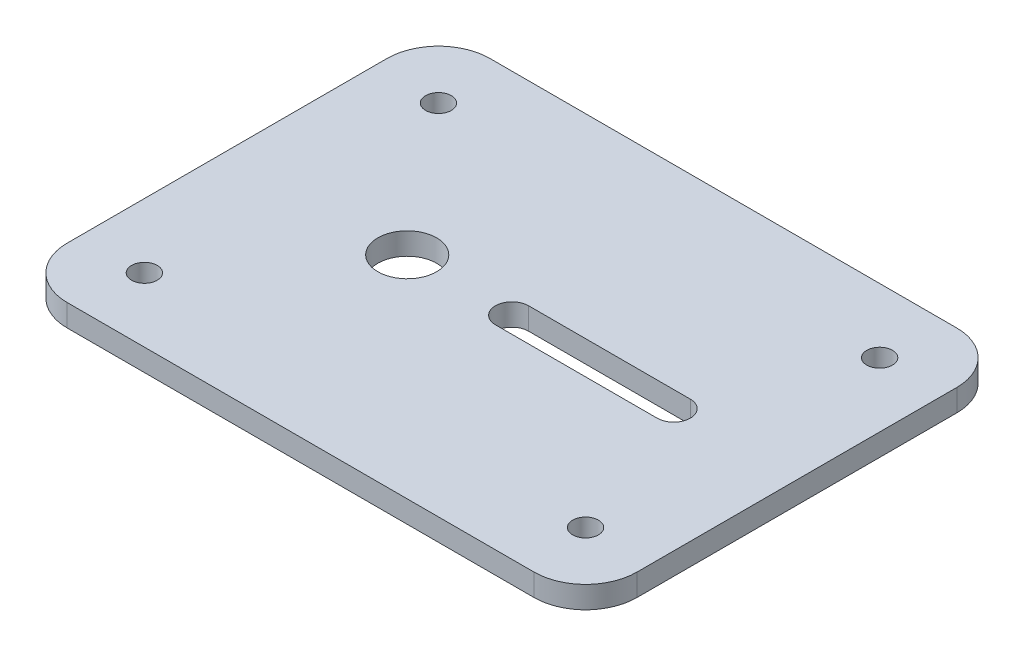
ISO-10303-21;
HEADER;
FILE_DESCRIPTION(('STEP AP214'),'2;1');
FILE_NAME('part.step','',(''),(''),'','','');
FILE_SCHEMA(('AUTOMOTIVE_DESIGN { 1 0 10303 214 1 1 1 1 }'));
ENDSEC;
DATA;
#1=APPLICATION_CONTEXT('core data for automotive mechanical design processes');
#2=APPLICATION_PROTOCOL_DEFINITION('international standard','automotive_design',2000,#1);
#3=PRODUCT_CONTEXT('',#1,'mechanical');
#4=PRODUCT('Part','Part','',(#3));
#5=PRODUCT_RELATED_PRODUCT_CATEGORY('part','',(#4));
#6=PRODUCT_DEFINITION_FORMATION('','',#4);
#7=PRODUCT_DEFINITION_CONTEXT('part definition',#1,'design');
#8=PRODUCT_DEFINITION('design','',#6,#7);
#9=PRODUCT_DEFINITION_SHAPE('','',#8);
#10=(LENGTH_UNIT() NAMED_UNIT(*) SI_UNIT(.MILLI.,.METRE.));
#11=(NAMED_UNIT(*) PLANE_ANGLE_UNIT() SI_UNIT($,.RADIAN.));
#12=(NAMED_UNIT(*) SI_UNIT($,.STERADIAN.) SOLID_ANGLE_UNIT());
#13=UNCERTAINTY_MEASURE_WITH_UNIT(LENGTH_MEASURE(1.E-05),#10,'distance_accuracy_value','');
#14=(GEOMETRIC_REPRESENTATION_CONTEXT(3) GLOBAL_UNCERTAINTY_ASSIGNED_CONTEXT((#13)) GLOBAL_UNIT_ASSIGNED_CONTEXT((#10,
#11,#12)) REPRESENTATION_CONTEXT('',''));
#15=CARTESIAN_POINT('',(0.,0.,0.));
#16=DIRECTION('',(0.,0.,1.));
#17=DIRECTION('',(1.,0.,0.));
#18=AXIS2_PLACEMENT_3D('',#15,#16,#17);
#19=CARTESIAN_POINT('',(16.6810344827586,-7.,13.75));
#20=DIRECTION('',(0.,1.,0.));
#21=DIRECTION('',(0.,0.,1.));
#22=AXIS2_PLACEMENT_3D('',#19,#20,#21);
#23=CYLINDRICAL_SURFACE('',#22,1.75);
#24=CARTESIAN_POINT('',(16.6810344827586,0.,13.75));
#25=DIRECTION('',(0.,-1.,0.));
#26=DIRECTION('',(0.,0.,-1.));
#27=AXIS2_PLACEMENT_3D('',#24,#25,#26);
#28=CIRCLE('',#27,1.75);
#29=CARTESIAN_POINT('',(16.6810344827586,0.,12.));
#30=VERTEX_POINT('',#29);
#31=EDGE_CURVE('E212',#30,#30,#28,.T.);
#32=ORIENTED_EDGE('',*,*,#31,.T.);
#33=EDGE_LOOP('',(#32));
#34=FACE_BOUND('',#33,.T.);
#35=CARTESIAN_POINT('',(16.6810344827586,3.,13.75));
#36=DIRECTION('',(0.,1.,0.));
#37=DIRECTION('',(0.,0.,1.));
#38=AXIS2_PLACEMENT_3D('',#35,#36,#37);
#39=CIRCLE('',#38,1.75);
#40=CARTESIAN_POINT('',(16.6810344827586,3.,15.5));
#41=VERTEX_POINT('',#40);
#42=EDGE_CURVE('E215',#41,#41,#39,.T.);
#43=ORIENTED_EDGE('',*,*,#42,.T.);
#44=EDGE_LOOP('',(#43));
#45=FACE_BOUND('',#44,.T.);
#46=ADVANCED_FACE('F35',(#34,#45),#23,.F.);
#47=CARTESIAN_POINT('',(-43.3189655172414,-7.,13.75));
#48=DIRECTION('',(0.,1.,0.));
#49=DIRECTION('',(0.,0.,1.));
#50=AXIS2_PLACEMENT_3D('',#47,#48,#49);
#51=CYLINDRICAL_SURFACE('',#50,1.75);
#52=CARTESIAN_POINT('',(-43.3189655172414,0.,13.75));
#53=DIRECTION('',(0.,-1.,0.));
#54=DIRECTION('',(0.,0.,-1.));
#55=AXIS2_PLACEMENT_3D('',#52,#53,#54);
#56=CIRCLE('',#55,1.75);
#57=CARTESIAN_POINT('',(-43.3189655172414,0.,12.));
#58=VERTEX_POINT('',#57);
#59=EDGE_CURVE('E200',#58,#58,#56,.T.);
#60=ORIENTED_EDGE('',*,*,#59,.T.);
#61=EDGE_LOOP('',(#60));
#62=FACE_BOUND('',#61,.T.);
#63=CARTESIAN_POINT('',(-43.3189655172414,3.,13.75));
#64=DIRECTION('',(0.,1.,0.));
#65=DIRECTION('',(0.,0.,1.));
#66=AXIS2_PLACEMENT_3D('',#63,#64,#65);
#67=CIRCLE('',#66,1.75);
#68=CARTESIAN_POINT('',(-43.3189655172414,3.,15.5));
#69=VERTEX_POINT('',#68);
#70=EDGE_CURVE('E209',#69,#69,#67,.T.);
#71=ORIENTED_EDGE('',*,*,#70,.T.);
#72=EDGE_LOOP('',(#71));
#73=FACE_BOUND('',#72,.T.);
#74=ADVANCED_FACE('F285',(#62,#73),#51,.F.);
#75=CARTESIAN_POINT('',(-52.0689655172414,3.,-35.));
#76=DIRECTION('',(0.,0.,1.));
#77=DIRECTION('',(1.,0.,0.));
#78=AXIS2_PLACEMENT_3D('',#75,#76,#77);
#79=PLANE('',#78);
#80=DIRECTION('',(-1.,0.,0.));
#81=VECTOR('',#80,1.);
#82=CARTESIAN_POINT('',(-52.0689655172414,3.,-35.));
#83=LINE('',#82,#81);
#84=CARTESIAN_POINT('',(18.4310344827586,3.,-35.));
#85=VERTEX_POINT('',#84);
#86=CARTESIAN_POINT('',(-45.0689655172414,3.,-35.));
#87=VERTEX_POINT('',#86);
#88=EDGE_CURVE('E193',#85,#87,#83,.T.);
#89=ORIENTED_EDGE('',*,*,#88,.F.);
#90=DIRECTION('',(0.,1.,0.));
#91=VECTOR('',#90,1.);
#92=CARTESIAN_POINT('',(18.4310344827586,3.,-35.));
#93=LINE('',#92,#91);
#94=CARTESIAN_POINT('',(18.4310344827586,0.,-35.));
#95=VERTEX_POINT('',#94);
#96=EDGE_CURVE('E233',#85,#95,#93,.F.);
#97=ORIENTED_EDGE('',*,*,#96,.T.);
#98=DIRECTION('',(-1.,0.,0.));
#99=VECTOR('',#98,1.);
#100=CARTESIAN_POINT('',(-52.0689655172414,0.,-35.));
#101=LINE('',#100,#99);
#102=CARTESIAN_POINT('',(-45.0689655172414,0.,-35.));
#103=VERTEX_POINT('',#102);
#104=EDGE_CURVE('E201',#95,#103,#101,.T.);
#105=ORIENTED_EDGE('',*,*,#104,.T.);
#106=DIRECTION('',(0.,-1.,0.));
#107=VECTOR('',#106,1.);
#108=CARTESIAN_POINT('',(-45.0689655172414,3.,-35.));
#109=LINE('',#108,#107);
#110=EDGE_CURVE('E231',#103,#87,#109,.F.);
#111=ORIENTED_EDGE('',*,*,#110,.T.);
#112=EDGE_LOOP('',(#89,#97,#105,#111));
#113=FACE_BOUND('',#112,.T.);
#114=ADVANCED_FACE('F263',(#113),#79,.F.);
#115=CARTESIAN_POINT('',(-52.0689655172414,3.,35.));
#116=DIRECTION('',(1.,0.,0.));
#117=DIRECTION('',(0.,0.,-1.));
#118=AXIS2_PLACEMENT_3D('',#115,#116,#117);
#119=PLANE('',#118);
#120=DIRECTION('',(0.,0.,1.));
#121=VECTOR('',#120,1.);
#122=CARTESIAN_POINT('',(-52.0689655172414,3.,35.));
#123=LINE('',#122,#121);
#124=CARTESIAN_POINT('',(-52.0689655172414,3.,-28.));
#125=VERTEX_POINT('',#124);
#126=CARTESIAN_POINT('',(-52.0689655172414,3.,15.5));
#127=VERTEX_POINT('',#126);
#128=EDGE_CURVE('E196',#125,#127,#123,.T.);
#129=ORIENTED_EDGE('',*,*,#128,.F.);
#130=DIRECTION('',(0.,-1.,0.));
#131=VECTOR('',#130,1.);
#132=CARTESIAN_POINT('',(-52.0689655172414,3.,-28.));
#133=LINE('',#132,#131);
#134=CARTESIAN_POINT('',(-52.0689655172414,0.,-28.));
#135=VERTEX_POINT('',#134);
#136=EDGE_CURVE('E11',#125,#135,#133,.T.);
#137=ORIENTED_EDGE('',*,*,#136,.T.);
#138=DIRECTION('',(0.,0.,1.));
#139=VECTOR('',#138,1.);
#140=CARTESIAN_POINT('',(-52.0689655172414,0.,35.));
#141=LINE('',#140,#139);
#142=CARTESIAN_POINT('',(-52.0689655172414,0.,15.5));
#143=VERTEX_POINT('',#142);
#144=EDGE_CURVE('E197',#135,#143,#141,.T.);
#145=ORIENTED_EDGE('',*,*,#144,.T.);
#146=DIRECTION('',(0.,1.,0.));
#147=VECTOR('',#146,1.);
#148=CARTESIAN_POINT('',(-52.0689655172414,3.,15.5));
#149=LINE('',#148,#147);
#150=EDGE_CURVE('E43',#143,#127,#149,.T.);
#151=ORIENTED_EDGE('',*,*,#150,.T.);
#152=EDGE_LOOP('',(#129,#137,#145,#151));
#153=FACE_BOUND('',#152,.T.);
#154=ADVANCED_FACE('F249',(#153),#119,.F.);
#155=CARTESIAN_POINT('',(0.,3.,0.));
#156=DIRECTION('',(0.,-1.,0.));
#157=DIRECTION('',(0.,0.,-1.));
#158=AXIS2_PLACEMENT_3D('',#155,#156,#157);
#159=PLANE('',#158);
#160=CARTESIAN_POINT('',(-27.5689655172414,3.,-6.25));
#161=DIRECTION('',(0.,1.,0.));
#162=DIRECTION('',(0.,0.,1.));
#163=AXIS2_PLACEMENT_3D('',#160,#161,#162);
#164=CIRCLE('',#163,4.);
#165=CARTESIAN_POINT('',(-27.5689655172414,3.,-2.25));
#166=VERTEX_POINT('',#165);
#167=EDGE_CURVE('E156',#166,#166,#164,.T.);
#168=ORIENTED_EDGE('',*,*,#167,.F.);
#169=EDGE_LOOP('',(#168));
#170=FACE_BOUND('',#169,.T.);
#171=DIRECTION('',(1.,0.,0.));
#172=VECTOR('',#171,1.);
#173=CARTESIAN_POINT('',(-13.3189655172414,3.,-4.));
#174=LINE('',#173,#172);
#175=CARTESIAN_POINT('',(-13.3189655172414,3.,-4.));
#176=VERTEX_POINT('',#175);
#177=CARTESIAN_POINT('',(8.68103448275863,3.,-4.));
#178=VERTEX_POINT('',#177);
#179=EDGE_CURVE('E162',#176,#178,#174,.T.);
#180=ORIENTED_EDGE('',*,*,#179,.F.);
#181=CARTESIAN_POINT('',(-13.3189655172414,3.,-6.25));
#182=DIRECTION('',(0.,1.,0.));
#183=DIRECTION('',(0.,0.,1.));
#184=AXIS2_PLACEMENT_3D('',#181,#182,#183);
#185=CIRCLE('',#184,2.25);
#186=CARTESIAN_POINT('',(-13.3189655172414,3.,-8.5));
#187=VERTEX_POINT('',#186);
#188=EDGE_CURVE('E133',#187,#176,#185,.T.);
#189=ORIENTED_EDGE('',*,*,#188,.F.);
#190=DIRECTION('',(-1.,0.,0.));
#191=VECTOR('',#190,1.);
#192=CARTESIAN_POINT('',(-13.3189655172414,3.,-8.5));
#193=LINE('',#192,#191);
#194=CARTESIAN_POINT('',(8.68103448275863,3.,-8.5));
#195=VERTEX_POINT('',#194);
#196=EDGE_CURVE('E150',#195,#187,#193,.T.);
#197=ORIENTED_EDGE('',*,*,#196,.F.);
#198=CARTESIAN_POINT('',(8.68103448275863,3.,-6.25));
#199=DIRECTION('',(0.,1.,0.));
#200=DIRECTION('',(0.,0.,1.));
#201=AXIS2_PLACEMENT_3D('',#198,#199,#200);
#202=CIRCLE('',#201,2.25);
#203=EDGE_CURVE('E153',#178,#195,#202,.T.);
#204=ORIENTED_EDGE('',*,*,#203,.F.);
#205=EDGE_LOOP('',(#180,#189,#197,#204));
#206=FACE_BOUND('',#205,.T.);
#207=CARTESIAN_POINT('',(16.6810344827586,3.,-26.25));
#208=DIRECTION('',(0.,1.,0.));
#209=DIRECTION('',(0.,0.,1.));
#210=AXIS2_PLACEMENT_3D('',#207,#208,#209);
#211=CIRCLE('',#210,1.75);
#212=CARTESIAN_POINT('',(16.6810344827586,3.,-24.5));
#213=VERTEX_POINT('',#212);
#214=EDGE_CURVE('E186',#213,#213,#211,.T.);
#215=ORIENTED_EDGE('',*,*,#214,.F.);
#216=EDGE_LOOP('',(#215));
#217=FACE_BOUND('',#216,.T.);
#218=CARTESIAN_POINT('',(-43.3189655172414,3.,-26.25));
#219=DIRECTION('',(0.,1.,0.));
#220=DIRECTION('',(0.,0.,1.));
#221=AXIS2_PLACEMENT_3D('',#218,#219,#220);
#222=CIRCLE('',#221,1.75);
#223=CARTESIAN_POINT('',(-43.3189655172414,3.,-24.5));
#224=VERTEX_POINT('',#223);
#225=EDGE_CURVE('E189',#224,#224,#222,.T.);
#226=ORIENTED_EDGE('',*,*,#225,.F.);
#227=EDGE_LOOP('',(#226));
#228=FACE_BOUND('',#227,.T.);
#229=DIRECTION('',(0.,0.,1.));
#230=VECTOR('',#229,1.);
#231=CARTESIAN_POINT('',(25.4310344827586,3.,22.5));
#232=LINE('',#231,#230);
#233=CARTESIAN_POINT('',(25.4310344827586,3.,-28.));
#234=VERTEX_POINT('',#233);
#235=CARTESIAN_POINT('',(25.4310344827586,3.,15.5));
#236=VERTEX_POINT('',#235);
#237=EDGE_CURVE('E178',#234,#236,#232,.T.);
#238=ORIENTED_EDGE('',*,*,#237,.F.);
#239=CARTESIAN_POINT('',(18.4310344827586,3.,-28.));
#240=DIRECTION('',(0.,-1.,0.));
#241=DIRECTION('',(0.,0.,-1.));
#242=AXIS2_PLACEMENT_3D('',#239,#240,#241);
#243=CIRCLE('',#242,7.);
#244=EDGE_CURVE('E229',#234,#85,#243,.F.);
#245=ORIENTED_EDGE('',*,*,#244,.T.);
#246=ORIENTED_EDGE('',*,*,#88,.T.);
#247=CARTESIAN_POINT('',(-45.0689655172414,3.,-28.));
#248=DIRECTION('',(0.,-1.,0.));
#249=DIRECTION('',(0.,0.,-1.));
#250=AXIS2_PLACEMENT_3D('',#247,#248,#249);
#251=CIRCLE('',#250,7.);
#252=EDGE_CURVE('E225',#87,#125,#251,.F.);
#253=ORIENTED_EDGE('',*,*,#252,.T.);
#254=ORIENTED_EDGE('',*,*,#128,.T.);
#255=CARTESIAN_POINT('',(-45.0689655172414,3.,15.5));
#256=DIRECTION('',(0.,-1.,0.));
#257=DIRECTION('',(0.,0.,-1.));
#258=AXIS2_PLACEMENT_3D('',#255,#256,#257);
#259=CIRCLE('',#258,7.);
#260=CARTESIAN_POINT('',(-45.0689655172414,3.,22.5));
#261=VERTEX_POINT('',#260);
#262=EDGE_CURVE('E223',#127,#261,#259,.F.);
#263=ORIENTED_EDGE('',*,*,#262,.T.);
#264=DIRECTION('',(-1.,0.,0.));
#265=VECTOR('',#264,1.);
#266=CARTESIAN_POINT('',(-52.0689655172414,3.,22.5));
#267=LINE('',#266,#265);
#268=CARTESIAN_POINT('',(18.4310344827586,3.,22.5));
#269=VERTEX_POINT('',#268);
#270=EDGE_CURVE('E175',#269,#261,#267,.T.);
#271=ORIENTED_EDGE('',*,*,#270,.F.);
#272=CARTESIAN_POINT('',(18.4310344827586,3.,15.5));
#273=DIRECTION('',(0.,-1.,0.));
#274=DIRECTION('',(0.,0.,-1.));
#275=AXIS2_PLACEMENT_3D('',#272,#273,#274);
#276=CIRCLE('',#275,7.);
#277=EDGE_CURVE('E227',#269,#236,#276,.F.);
#278=ORIENTED_EDGE('',*,*,#277,.T.);
#279=EDGE_LOOP('',(#238,#245,#246,#253,#254,#263,#271,#278));
#280=FACE_BOUND('',#279,.T.);
#281=ORIENTED_EDGE('',*,*,#70,.F.);
#282=EDGE_LOOP('',(#281));
#283=FACE_BOUND('',#282,.T.);
#284=ORIENTED_EDGE('',*,*,#42,.F.);
#285=EDGE_LOOP('',(#284));
#286=FACE_BOUND('',#285,.T.);
#287=ADVANCED_FACE('F253',(#170,#206,#217,#228,#280,#283,#286),#159,.F.);
#288=CARTESIAN_POINT('',(0.,0.,0.));
#289=DIRECTION('',(0.,-1.,0.));
#290=DIRECTION('',(0.,0.,-1.));
#291=AXIS2_PLACEMENT_3D('',#288,#289,#290);
#292=PLANE('',#291);
#293=CARTESIAN_POINT('',(-27.5689655172414,0.,-6.25));
#294=DIRECTION('',(0.,1.,0.));
#295=DIRECTION('',(0.,0.,1.));
#296=AXIS2_PLACEMENT_3D('',#293,#294,#295);
#297=CIRCLE('',#296,4.);
#298=CARTESIAN_POINT('',(-27.5689655172414,0.,-2.25));
#299=VERTEX_POINT('',#298);
#300=EDGE_CURVE('E181',#299,#299,#297,.T.);
#301=ORIENTED_EDGE('',*,*,#300,.T.);
#302=EDGE_LOOP('',(#301));
#303=FACE_BOUND('',#302,.T.);
#304=CARTESIAN_POINT('',(-13.3189655172414,0.,-6.25));
#305=DIRECTION('',(0.,1.,0.));
#306=DIRECTION('',(0.,0.,1.));
#307=AXIS2_PLACEMENT_3D('',#304,#305,#306);
#308=CIRCLE('',#307,2.25);
#309=CARTESIAN_POINT('',(-13.3189655172414,0.,-8.5));
#310=VERTEX_POINT('',#309);
#311=CARTESIAN_POINT('',(-13.3189655172414,0.,-4.));
#312=VERTEX_POINT('',#311);
#313=EDGE_CURVE('E130',#310,#312,#308,.T.);
#314=ORIENTED_EDGE('',*,*,#313,.T.);
#315=DIRECTION('',(1.,0.,0.));
#316=VECTOR('',#315,1.);
#317=CARTESIAN_POINT('',(-13.3189655172414,0.,-4.));
#318=LINE('',#317,#316);
#319=CARTESIAN_POINT('',(8.68103448275863,0.,-4.));
#320=VERTEX_POINT('',#319);
#321=EDGE_CURVE('E142',#312,#320,#318,.T.);
#322=ORIENTED_EDGE('',*,*,#321,.T.);
#323=CARTESIAN_POINT('',(8.68103448275863,0.,-6.25));
#324=DIRECTION('',(0.,1.,0.));
#325=DIRECTION('',(0.,0.,1.));
#326=AXIS2_PLACEMENT_3D('',#323,#324,#325);
#327=CIRCLE('',#326,2.25);
#328=CARTESIAN_POINT('',(8.68103448275863,0.,-8.5));
#329=VERTEX_POINT('',#328);
#330=EDGE_CURVE('E146',#320,#329,#327,.T.);
#331=ORIENTED_EDGE('',*,*,#330,.T.);
#332=DIRECTION('',(-1.,0.,0.));
#333=VECTOR('',#332,1.);
#334=CARTESIAN_POINT('',(-13.3189655172414,0.,-8.5));
#335=LINE('',#334,#333);
#336=EDGE_CURVE('E138',#329,#310,#335,.T.);
#337=ORIENTED_EDGE('',*,*,#336,.T.);
#338=EDGE_LOOP('',(#314,#322,#331,#337));
#339=FACE_BOUND('',#338,.T.);
#340=ORIENTED_EDGE('',*,*,#104,.F.);
#341=CARTESIAN_POINT('',(18.4310344827586,0.,-28.));
#342=DIRECTION('',(0.,-1.,0.));
#343=DIRECTION('',(0.,0.,-1.));
#344=AXIS2_PLACEMENT_3D('',#341,#342,#343);
#345=CIRCLE('',#344,7.);
#346=CARTESIAN_POINT('',(25.4310344827586,0.,-28.));
#347=VERTEX_POINT('',#346);
#348=EDGE_CURVE('E239',#95,#347,#345,.T.);
#349=ORIENTED_EDGE('',*,*,#348,.T.);
#350=DIRECTION('',(0.,0.,1.));
#351=VECTOR('',#350,1.);
#352=CARTESIAN_POINT('',(25.4310344827586,0.,22.5));
#353=LINE('',#352,#351);
#354=CARTESIAN_POINT('',(25.4310344827586,0.,15.5));
#355=VERTEX_POINT('',#354);
#356=EDGE_CURVE('E171',#347,#355,#353,.T.);
#357=ORIENTED_EDGE('',*,*,#356,.T.);
#358=CARTESIAN_POINT('',(18.4310344827586,0.,15.5));
#359=DIRECTION('',(0.,-1.,0.));
#360=DIRECTION('',(0.,0.,-1.));
#361=AXIS2_PLACEMENT_3D('',#358,#359,#360);
#362=CIRCLE('',#361,7.);
#363=CARTESIAN_POINT('',(18.4310344827586,0.,22.5));
#364=VERTEX_POINT('',#363);
#365=EDGE_CURVE('E237',#355,#364,#362,.T.);
#366=ORIENTED_EDGE('',*,*,#365,.T.);
#367=DIRECTION('',(-1.,0.,0.));
#368=VECTOR('',#367,1.);
#369=CARTESIAN_POINT('',(-52.0689655172414,0.,22.5));
#370=LINE('',#369,#368);
#371=CARTESIAN_POINT('',(-45.0689655172414,0.,22.5));
#372=VERTEX_POINT('',#371);
#373=EDGE_CURVE('E174',#364,#372,#370,.T.);
#374=ORIENTED_EDGE('',*,*,#373,.T.);
#375=CARTESIAN_POINT('',(-45.0689655172414,0.,15.5));
#376=DIRECTION('',(0.,-1.,0.));
#377=DIRECTION('',(0.,0.,-1.));
#378=AXIS2_PLACEMENT_3D('',#375,#376,#377);
#379=CIRCLE('',#378,7.);
#380=EDGE_CURVE('E50',#372,#143,#379,.T.);
#381=ORIENTED_EDGE('',*,*,#380,.T.);
#382=ORIENTED_EDGE('',*,*,#144,.F.);
#383=CARTESIAN_POINT('',(-45.0689655172414,0.,-28.));
#384=DIRECTION('',(0.,-1.,0.));
#385=DIRECTION('',(0.,0.,-1.));
#386=AXIS2_PLACEMENT_3D('',#383,#384,#385);
#387=CIRCLE('',#386,7.);
#388=EDGE_CURVE('E58',#135,#103,#387,.T.);
#389=ORIENTED_EDGE('',*,*,#388,.T.);
#390=EDGE_LOOP('',(#340,#349,#357,#366,#374,#381,#382,#389));
#391=FACE_BOUND('',#390,.T.);
#392=CARTESIAN_POINT('',(16.6810344827586,0.,-26.25));
#393=DIRECTION('',(0.,-1.,0.));
#394=DIRECTION('',(0.,0.,-1.));
#395=AXIS2_PLACEMENT_3D('',#392,#393,#394);
#396=CIRCLE('',#395,1.75);
#397=CARTESIAN_POINT('',(16.6810344827586,0.,-28.));
#398=VERTEX_POINT('',#397);
#399=EDGE_CURVE('E177',#398,#398,#396,.T.);
#400=ORIENTED_EDGE('',*,*,#399,.F.);
#401=EDGE_LOOP('',(#400));
#402=FACE_BOUND('',#401,.T.);
#403=CARTESIAN_POINT('',(-43.3189655172414,0.,-26.25));
#404=DIRECTION('',(0.,-1.,0.));
#405=DIRECTION('',(0.,0.,-1.));
#406=AXIS2_PLACEMENT_3D('',#403,#404,#405);
#407=CIRCLE('',#406,1.75);
#408=CARTESIAN_POINT('',(-43.3189655172414,0.,-28.));
#409=VERTEX_POINT('',#408);
#410=EDGE_CURVE('E192',#409,#409,#407,.T.);
#411=ORIENTED_EDGE('',*,*,#410,.F.);
#412=EDGE_LOOP('',(#411));
#413=FACE_BOUND('',#412,.T.);
#414=ORIENTED_EDGE('',*,*,#59,.F.);
#415=EDGE_LOOP('',(#414));
#416=FACE_BOUND('',#415,.T.);
#417=ORIENTED_EDGE('',*,*,#31,.F.);
#418=EDGE_LOOP('',(#417));
#419=FACE_BOUND('',#418,.T.);
#420=ADVANCED_FACE('F148',(#303,#339,#391,#402,#413,#416,#419),#292,.T.);
#421=CARTESIAN_POINT('',(-43.3189655172414,-7.,-26.25));
#422=DIRECTION('',(0.,1.,0.));
#423=DIRECTION('',(0.,0.,1.));
#424=AXIS2_PLACEMENT_3D('',#421,#422,#423);
#425=CYLINDRICAL_SURFACE('',#424,1.75);
#426=ORIENTED_EDGE('',*,*,#410,.T.);
#427=EDGE_LOOP('',(#426));
#428=FACE_BOUND('',#427,.T.);
#429=ORIENTED_EDGE('',*,*,#225,.T.);
#430=EDGE_LOOP('',(#429));
#431=FACE_BOUND('',#430,.T.);
#432=ADVANCED_FACE('F385',(#428,#431),#425,.F.);
#433=CARTESIAN_POINT('',(16.6810344827586,-7.,-26.25));
#434=DIRECTION('',(0.,1.,0.));
#435=DIRECTION('',(0.,0.,1.));
#436=AXIS2_PLACEMENT_3D('',#433,#434,#435);
#437=CYLINDRICAL_SURFACE('',#436,1.75);
#438=ORIENTED_EDGE('',*,*,#399,.T.);
#439=EDGE_LOOP('',(#438));
#440=FACE_BOUND('',#439,.T.);
#441=ORIENTED_EDGE('',*,*,#214,.T.);
#442=EDGE_LOOP('',(#441));
#443=FACE_BOUND('',#442,.T.);
#444=ADVANCED_FACE('F377',(#440,#443),#437,.F.);
#445=CARTESIAN_POINT('',(-52.0689655172414,0.,22.5));
#446=DIRECTION('',(0.,0.,-1.));
#447=DIRECTION('',(-1.,0.,0.));
#448=AXIS2_PLACEMENT_3D('',#445,#446,#447);
#449=PLANE('',#448);
#450=ORIENTED_EDGE('',*,*,#373,.F.);
#451=DIRECTION('',(0.,1.,0.));
#452=VECTOR('',#451,1.);
#453=CARTESIAN_POINT('',(18.4310344827586,0.,22.5));
#454=LINE('',#453,#452);
#455=EDGE_CURVE('E243',#364,#269,#454,.T.);
#456=ORIENTED_EDGE('',*,*,#455,.T.);
#457=ORIENTED_EDGE('',*,*,#270,.T.);
#458=DIRECTION('',(0.,1.,0.));
#459=VECTOR('',#458,1.);
#460=CARTESIAN_POINT('',(-45.0689655172414,0.,22.5));
#461=LINE('',#460,#459);
#462=EDGE_CURVE('E241',#261,#372,#461,.F.);
#463=ORIENTED_EDGE('',*,*,#462,.T.);
#464=EDGE_LOOP('',(#450,#456,#457,#463));
#465=FACE_BOUND('',#464,.T.);
#466=ADVANCED_FACE('F278',(#465),#449,.F.);
#467=CARTESIAN_POINT('',(25.4310344827586,0.,22.5));
#468=DIRECTION('',(-1.,0.,0.));
#469=DIRECTION('',(0.,0.,1.));
#470=AXIS2_PLACEMENT_3D('',#467,#468,#469);
#471=PLANE('',#470);
#472=ORIENTED_EDGE('',*,*,#356,.F.);
#473=DIRECTION('',(0.,1.,0.));
#474=VECTOR('',#473,1.);
#475=CARTESIAN_POINT('',(25.4310344827586,0.,-28.));
#476=LINE('',#475,#474);
#477=EDGE_CURVE('E220',#347,#234,#476,.T.);
#478=ORIENTED_EDGE('',*,*,#477,.T.);
#479=ORIENTED_EDGE('',*,*,#237,.T.);
#480=DIRECTION('',(0.,1.,0.));
#481=VECTOR('',#480,1.);
#482=CARTESIAN_POINT('',(25.4310344827586,0.,15.5));
#483=LINE('',#482,#481);
#484=EDGE_CURVE('E218',#236,#355,#483,.F.);
#485=ORIENTED_EDGE('',*,*,#484,.T.);
#486=EDGE_LOOP('',(#472,#478,#479,#485));
#487=FACE_BOUND('',#486,.T.);
#488=ADVANCED_FACE('F271',(#487),#471,.F.);
#489=CARTESIAN_POINT('',(-13.3189655172414,0.,-6.25));
#490=DIRECTION('',(0.,1.,0.));
#491=DIRECTION('',(0.,0.,1.));
#492=AXIS2_PLACEMENT_3D('',#489,#490,#491);
#493=CYLINDRICAL_SURFACE('',#492,2.25);
#494=ORIENTED_EDGE('',*,*,#188,.T.);
#495=DIRECTION('',(0.,1.,0.));
#496=VECTOR('',#495,1.);
#497=CARTESIAN_POINT('',(-13.3189655172414,0.,-4.));
#498=LINE('',#497,#496);
#499=EDGE_CURVE('E126',#312,#176,#498,.T.);
#500=ORIENTED_EDGE('',*,*,#499,.F.);
#501=ORIENTED_EDGE('',*,*,#313,.F.);
#502=DIRECTION('',(0.,1.,0.));
#503=VECTOR('',#502,1.);
#504=CARTESIAN_POINT('',(-13.3189655172414,0.,-8.5));
#505=LINE('',#504,#503);
#506=EDGE_CURVE('E166',#310,#187,#505,.T.);
#507=ORIENTED_EDGE('',*,*,#506,.T.);
#508=EDGE_LOOP('',(#494,#500,#501,#507));
#509=FACE_BOUND('',#508,.T.);
#510=ADVANCED_FACE('F128',(#509),#493,.F.);
#511=CARTESIAN_POINT('',(-13.3189655172414,0.,-8.5));
#512=DIRECTION('',(0.,0.,-1.));
#513=DIRECTION('',(-1.,0.,0.));
#514=AXIS2_PLACEMENT_3D('',#511,#512,#513);
#515=PLANE('',#514);
#516=ORIENTED_EDGE('',*,*,#196,.T.);
#517=ORIENTED_EDGE('',*,*,#506,.F.);
#518=ORIENTED_EDGE('',*,*,#336,.F.);
#519=DIRECTION('',(0.,1.,0.));
#520=VECTOR('',#519,1.);
#521=CARTESIAN_POINT('',(8.68103448275863,0.,-8.5));
#522=LINE('',#521,#520);
#523=EDGE_CURVE('E168',#329,#195,#522,.T.);
#524=ORIENTED_EDGE('',*,*,#523,.T.);
#525=EDGE_LOOP('',(#516,#517,#518,#524));
#526=FACE_BOUND('',#525,.T.);
#527=ADVANCED_FACE('F346',(#526),#515,.F.);
#528=CARTESIAN_POINT('',(8.68103448275863,0.,-6.25));
#529=DIRECTION('',(0.,1.,0.));
#530=DIRECTION('',(0.,0.,1.));
#531=AXIS2_PLACEMENT_3D('',#528,#529,#530);
#532=CYLINDRICAL_SURFACE('',#531,2.25);
#533=ORIENTED_EDGE('',*,*,#203,.T.);
#534=ORIENTED_EDGE('',*,*,#523,.F.);
#535=ORIENTED_EDGE('',*,*,#330,.F.);
#536=DIRECTION('',(0.,1.,0.));
#537=VECTOR('',#536,1.);
#538=CARTESIAN_POINT('',(8.68103448275863,0.,-4.));
#539=LINE('',#538,#537);
#540=EDGE_CURVE('E137',#320,#178,#539,.T.);
#541=ORIENTED_EDGE('',*,*,#540,.T.);
#542=EDGE_LOOP('',(#533,#534,#535,#541));
#543=FACE_BOUND('',#542,.T.);
#544=ADVANCED_FACE('F338',(#543),#532,.F.);
#545=CARTESIAN_POINT('',(-13.3189655172414,0.,-4.));
#546=DIRECTION('',(0.,0.,1.));
#547=DIRECTION('',(1.,0.,0.));
#548=AXIS2_PLACEMENT_3D('',#545,#546,#547);
#549=PLANE('',#548);
#550=ORIENTED_EDGE('',*,*,#179,.T.);
#551=ORIENTED_EDGE('',*,*,#540,.F.);
#552=ORIENTED_EDGE('',*,*,#321,.F.);
#553=ORIENTED_EDGE('',*,*,#499,.T.);
#554=EDGE_LOOP('',(#550,#551,#552,#553));
#555=FACE_BOUND('',#554,.T.);
#556=ADVANCED_FACE('F143',(#555),#549,.F.);
#557=CARTESIAN_POINT('',(-27.5689655172414,0.,-6.25));
#558=DIRECTION('',(0.,1.,0.));
#559=DIRECTION('',(0.,0.,1.));
#560=AXIS2_PLACEMENT_3D('',#557,#558,#559);
#561=CYLINDRICAL_SURFACE('',#560,4.);
#562=ORIENTED_EDGE('',*,*,#300,.F.);
#563=EDGE_LOOP('',(#562));
#564=FACE_BOUND('',#563,.T.);
#565=ORIENTED_EDGE('',*,*,#167,.T.);
#566=EDGE_LOOP('',(#565));
#567=FACE_BOUND('',#566,.T.);
#568=ADVANCED_FACE('F298',(#564,#567),#561,.F.);
#569=CARTESIAN_POINT('',(18.4310344827586,0.,-28.));
#570=DIRECTION('',(0.,1.,0.));
#571=DIRECTION('',(0.,0.,1.));
#572=AXIS2_PLACEMENT_3D('',#569,#570,#571);
#573=CYLINDRICAL_SURFACE('',#572,7.);
#574=ORIENTED_EDGE('',*,*,#348,.F.);
#575=ORIENTED_EDGE('',*,*,#96,.F.);
#576=ORIENTED_EDGE('',*,*,#244,.F.);
#577=ORIENTED_EDGE('',*,*,#477,.F.);
#578=EDGE_LOOP('',(#574,#575,#576,#577));
#579=FACE_BOUND('',#578,.T.);
#580=ADVANCED_FACE('F266',(#579),#573,.T.);
#581=CARTESIAN_POINT('',(18.4310344827586,0.,15.5));
#582=DIRECTION('',(0.,1.,0.));
#583=DIRECTION('',(0.,0.,1.));
#584=AXIS2_PLACEMENT_3D('',#581,#582,#583);
#585=CYLINDRICAL_SURFACE('',#584,7.);
#586=ORIENTED_EDGE('',*,*,#365,.F.);
#587=ORIENTED_EDGE('',*,*,#484,.F.);
#588=ORIENTED_EDGE('',*,*,#277,.F.);
#589=ORIENTED_EDGE('',*,*,#455,.F.);
#590=EDGE_LOOP('',(#586,#587,#588,#589));
#591=FACE_BOUND('',#590,.T.);
#592=ADVANCED_FACE('F274',(#591),#585,.T.);
#593=CARTESIAN_POINT('',(-45.0689655172414,3.,-28.));
#594=DIRECTION('',(0.,-1.,0.));
#595=DIRECTION('',(0.,0.,-1.));
#596=AXIS2_PLACEMENT_3D('',#593,#594,#595);
#597=CYLINDRICAL_SURFACE('',#596,7.);
#598=ORIENTED_EDGE('',*,*,#252,.F.);
#599=ORIENTED_EDGE('',*,*,#110,.F.);
#600=ORIENTED_EDGE('',*,*,#388,.F.);
#601=ORIENTED_EDGE('',*,*,#136,.F.);
#602=EDGE_LOOP('',(#598,#599,#600,#601));
#603=FACE_BOUND('',#602,.T.);
#604=ADVANCED_FACE('F258',(#603),#597,.T.);
#605=CARTESIAN_POINT('',(-45.0689655172414,3.,15.5));
#606=DIRECTION('',(0.,1.,0.));
#607=DIRECTION('',(0.,0.,1.));
#608=AXIS2_PLACEMENT_3D('',#605,#606,#607);
#609=CYLINDRICAL_SURFACE('',#608,7.);
#610=ORIENTED_EDGE('',*,*,#380,.F.);
#611=ORIENTED_EDGE('',*,*,#462,.F.);
#612=ORIENTED_EDGE('',*,*,#262,.F.);
#613=ORIENTED_EDGE('',*,*,#150,.F.);
#614=EDGE_LOOP('',(#610,#611,#612,#613));
#615=FACE_BOUND('',#614,.T.);
#616=ADVANCED_FACE('F37',(#615),#609,.T.);
#617=CLOSED_SHELL('',(#46,#74,#114,#154,#287,#420,#432,#444,#466,#488,#510,#527,#544,#556,#568,
#580,#592,#604,#616));
#618=MANIFOLD_SOLID_BREP('B2',#617);
#619=ADVANCED_BREP_SHAPE_REPRESENTATION('',(#18,#618),#14);
#620=SHAPE_DEFINITION_REPRESENTATION(#9,#619);
ENDSEC;
END-ISO-10303-21;
